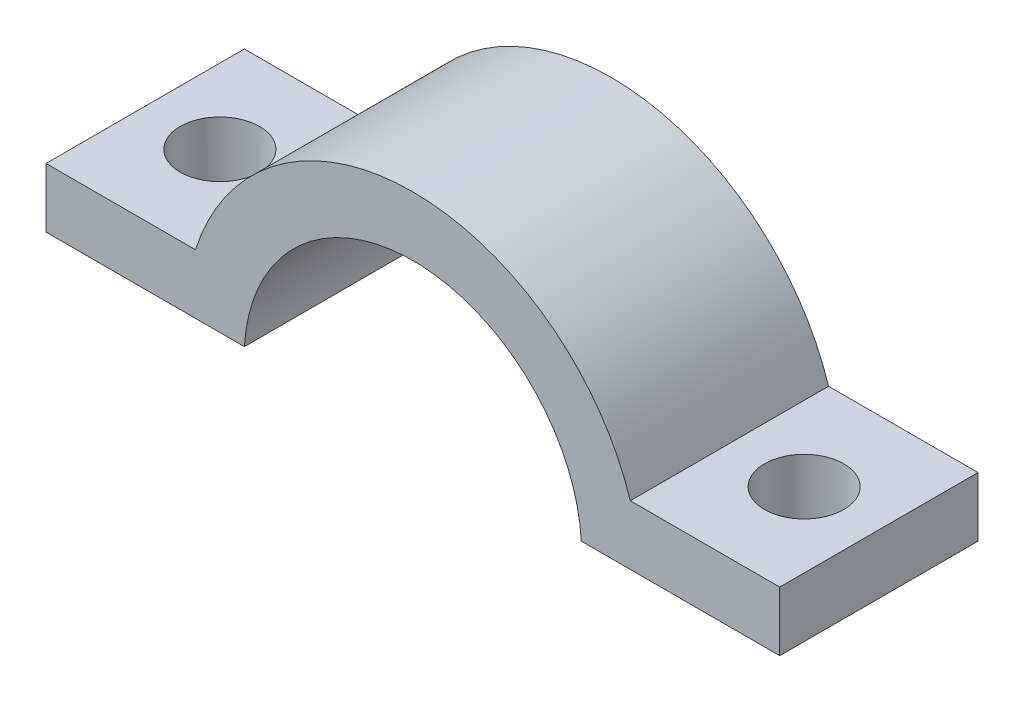
ISO-10303-21;
HEADER;
FILE_DESCRIPTION(('STEP AP214'),'2;1');
FILE_NAME('part.step','',(''),(''),'','','');
FILE_SCHEMA(('AUTOMOTIVE_DESIGN { 1 0 10303 214 1 1 1 1 }'));
ENDSEC;
DATA;
#1=APPLICATION_CONTEXT('core data for automotive mechanical design processes');
#2=APPLICATION_PROTOCOL_DEFINITION('international standard','automotive_design',2000,#1);
#3=PRODUCT_CONTEXT('',#1,'mechanical');
#4=PRODUCT('Part','Part','',(#3));
#5=PRODUCT_RELATED_PRODUCT_CATEGORY('part','',(#4));
#6=PRODUCT_DEFINITION_FORMATION('','',#4);
#7=PRODUCT_DEFINITION_CONTEXT('part definition',#1,'design');
#8=PRODUCT_DEFINITION('design','',#6,#7);
#9=PRODUCT_DEFINITION_SHAPE('','',#8);
#10=(LENGTH_UNIT() NAMED_UNIT(*) SI_UNIT(.MILLI.,.METRE.));
#11=(NAMED_UNIT(*) PLANE_ANGLE_UNIT() SI_UNIT($,.RADIAN.));
#12=(NAMED_UNIT(*) SI_UNIT($,.STERADIAN.) SOLID_ANGLE_UNIT());
#13=UNCERTAINTY_MEASURE_WITH_UNIT(LENGTH_MEASURE(1.E-05),#10,'distance_accuracy_value','');
#14=(GEOMETRIC_REPRESENTATION_CONTEXT(3) GLOBAL_UNCERTAINTY_ASSIGNED_CONTEXT((#13)) GLOBAL_UNIT_ASSIGNED_CONTEXT((#10,
#11,#12)) REPRESENTATION_CONTEXT('',''));
#15=CARTESIAN_POINT('',(0.,0.,0.));
#16=DIRECTION('',(0.,0.,1.));
#17=DIRECTION('',(1.,0.,0.));
#18=AXIS2_PLACEMENT_3D('',#15,#16,#17);
#19=CARTESIAN_POINT('',(8.49529869986924,0.499999999999997,10.));
#20=DIRECTION('',(0.,1.,0.));
#21=DIRECTION('',(-1.,0.,0.));
#22=AXIS2_PLACEMENT_3D('',#19,#20,#21);
#23=PLANE('',#22);
#24=DIRECTION('',(1.,0.,0.));
#25=VECTOR('',#24,1.);
#26=CARTESIAN_POINT('',(8.49529869986924,0.499999999999997,0.));
#27=LINE('',#26,#25);
#28=CARTESIAN_POINT('',(8.49529869986924,0.499999999999997,0.));
#29=VERTEX_POINT('',#28);
#30=CARTESIAN_POINT('',(18.5,0.499999999999995,0.));
#31=VERTEX_POINT('',#30);
#32=EDGE_CURVE('E143',#29,#31,#27,.T.);
#33=ORIENTED_EDGE('',*,*,#32,.T.);
#34=DIRECTION('',(0.,0.,-1.));
#35=VECTOR('',#34,1.);
#36=CARTESIAN_POINT('',(18.5,0.499999999999995,10.));
#37=LINE('',#36,#35);
#38=CARTESIAN_POINT('',(18.5,0.499999999999995,10.));
#39=VERTEX_POINT('',#38);
#40=EDGE_CURVE('E123',#39,#31,#37,.T.);
#41=ORIENTED_EDGE('',*,*,#40,.F.);
#42=DIRECTION('',(1.,0.,0.));
#43=VECTOR('',#42,1.);
#44=CARTESIAN_POINT('',(8.49529869986924,0.499999999999997,10.));
#45=LINE('',#44,#43);
#46=CARTESIAN_POINT('',(8.49529869986924,0.499999999999997,10.));
#47=VERTEX_POINT('',#46);
#48=EDGE_CURVE('E114',#47,#39,#45,.T.);
#49=ORIENTED_EDGE('',*,*,#48,.F.);
#50=DIRECTION('',(0.,0.,-1.));
#51=VECTOR('',#50,1.);
#52=CARTESIAN_POINT('',(8.49529869986924,0.499999999999997,10.));
#53=LINE('',#52,#51);
#54=EDGE_CURVE('E152',#47,#29,#53,.T.);
#55=ORIENTED_EDGE('',*,*,#54,.T.);
#56=EDGE_LOOP('',(#33,#41,#49,#55));
#57=FACE_BOUND('',#56,.T.);
#58=CARTESIAN_POINT('',(14.7324489890025,0.499999999999997,5.));
#59=DIRECTION('',(0.,1.,0.));
#60=DIRECTION('',(-1.,0.,0.));
#61=AXIS2_PLACEMENT_3D('',#58,#59,#60);
#62=CIRCLE('',#61,2.);
#63=CARTESIAN_POINT('',(12.7324489890025,0.499999999999997,5.));
#64=VERTEX_POINT('',#63);
#65=EDGE_CURVE('E187',#64,#64,#62,.T.);
#66=ORIENTED_EDGE('',*,*,#65,.T.);
#67=EDGE_LOOP('',(#66));
#68=FACE_BOUND('',#67,.T.);
#69=ADVANCED_FACE('F35',(#57,#68),#23,.F.);
#70=CARTESIAN_POINT('',(10.964898554331,3.5001570955073,10.));
#71=DIRECTION('',(0.,-1.,0.));
#72=DIRECTION('',(1.,0.,0.));
#73=AXIS2_PLACEMENT_3D('',#70,#71,#72);
#74=PLANE('',#73);
#75=DIRECTION('',(-1.,0.,0.));
#76=VECTOR('',#75,1.);
#77=CARTESIAN_POINT('',(10.964898554331,3.5001570955073,0.));
#78=LINE('',#77,#76);
#79=CARTESIAN_POINT('',(18.5,3.50015709550731,0.));
#80=VERTEX_POINT('',#79);
#81=CARTESIAN_POINT('',(10.964898554331,3.5001570955073,0.));
#82=VERTEX_POINT('',#81);
#83=EDGE_CURVE('E81',#80,#82,#78,.T.);
#84=ORIENTED_EDGE('',*,*,#83,.T.);
#85=DIRECTION('',(0.,0.,-1.));
#86=VECTOR('',#85,1.);
#87=CARTESIAN_POINT('',(10.964898554331,3.5001570955073,10.));
#88=LINE('',#87,#86);
#89=CARTESIAN_POINT('',(10.964898554331,3.5001570955073,10.));
#90=VERTEX_POINT('',#89);
#91=EDGE_CURVE('E124',#90,#82,#88,.T.);
#92=ORIENTED_EDGE('',*,*,#91,.F.);
#93=DIRECTION('',(-1.,0.,0.));
#94=VECTOR('',#93,1.);
#95=CARTESIAN_POINT('',(10.964898554331,3.5001570955073,10.));
#96=LINE('',#95,#94);
#97=CARTESIAN_POINT('',(18.5,3.50015709550731,10.));
#98=VERTEX_POINT('',#97);
#99=EDGE_CURVE('E112',#98,#90,#96,.T.);
#100=ORIENTED_EDGE('',*,*,#99,.F.);
#101=DIRECTION('',(0.,0.,-1.));
#102=VECTOR('',#101,1.);
#103=CARTESIAN_POINT('',(18.5,3.50015709550731,10.));
#104=LINE('',#103,#102);
#105=EDGE_CURVE('E119',#98,#80,#104,.T.);
#106=ORIENTED_EDGE('',*,*,#105,.T.);
#107=EDGE_LOOP('',(#84,#92,#100,#106));
#108=FACE_BOUND('',#107,.T.);
#109=CARTESIAN_POINT('',(14.7324489890025,3.50015709550731,5.));
#110=DIRECTION('',(0.,-1.,0.));
#111=DIRECTION('',(1.,0.,0.));
#112=AXIS2_PLACEMENT_3D('',#109,#110,#111);
#113=CIRCLE('',#112,2.);
#114=CARTESIAN_POINT('',(16.7324489890025,3.50015709550731,5.));
#115=VERTEX_POINT('',#114);
#116=EDGE_CURVE('E190',#115,#115,#113,.T.);
#117=ORIENTED_EDGE('',*,*,#116,.T.);
#118=EDGE_LOOP('',(#117));
#119=FACE_BOUND('',#118,.T.);
#120=ADVANCED_FACE('F126',(#108,#119),#74,.F.);
#121=CARTESIAN_POINT('',(-10.964898554331,3.5001570955073,10.));
#122=DIRECTION('',(0.,-1.,0.));
#123=DIRECTION('',(1.,0.,0.));
#124=AXIS2_PLACEMENT_3D('',#121,#122,#123);
#125=PLANE('',#124);
#126=DIRECTION('',(-1.,0.,0.));
#127=VECTOR('',#126,1.);
#128=CARTESIAN_POINT('',(-10.964898554331,3.5001570955073,0.));
#129=LINE('',#128,#127);
#130=CARTESIAN_POINT('',(-10.964898554331,3.50015709550731,0.));
#131=VERTEX_POINT('',#130);
#132=CARTESIAN_POINT('',(-18.5,3.50015709550731,0.));
#133=VERTEX_POINT('',#132);
#134=EDGE_CURVE('E133',#131,#133,#129,.T.);
#135=ORIENTED_EDGE('',*,*,#134,.T.);
#136=DIRECTION('',(0.,0.,-1.));
#137=VECTOR('',#136,1.);
#138=CARTESIAN_POINT('',(-18.5,3.50015709550731,10.));
#139=LINE('',#138,#137);
#140=CARTESIAN_POINT('',(-18.5,3.50015709550731,10.));
#141=VERTEX_POINT('',#140);
#142=EDGE_CURVE('E11',#141,#133,#139,.T.);
#143=ORIENTED_EDGE('',*,*,#142,.F.);
#144=DIRECTION('',(-1.,0.,0.));
#145=VECTOR('',#144,1.);
#146=CARTESIAN_POINT('',(-10.964898554331,3.5001570955073,10.));
#147=LINE('',#146,#145);
#148=CARTESIAN_POINT('',(-10.964898554331,3.50015709550731,10.));
#149=VERTEX_POINT('',#148);
#150=EDGE_CURVE('E148',#149,#141,#147,.T.);
#151=ORIENTED_EDGE('',*,*,#150,.F.);
#152=DIRECTION('',(0.,0.,-1.));
#153=VECTOR('',#152,1.);
#154=CARTESIAN_POINT('',(-10.964898554331,3.50015709550731,10.));
#155=LINE('',#154,#153);
#156=EDGE_CURVE('E129',#149,#131,#155,.T.);
#157=ORIENTED_EDGE('',*,*,#156,.T.);
#158=EDGE_LOOP('',(#135,#143,#151,#157));
#159=FACE_BOUND('',#158,.T.);
#160=CARTESIAN_POINT('',(-14.7324489890025,3.50015709550731,5.));
#161=DIRECTION('',(0.,-1.,0.));
#162=DIRECTION('',(1.,0.,0.));
#163=AXIS2_PLACEMENT_3D('',#160,#161,#162);
#164=CIRCLE('',#163,2.);
#165=CARTESIAN_POINT('',(-12.7324489890025,3.50015709550731,5.));
#166=VERTEX_POINT('',#165);
#167=EDGE_CURVE('E137',#166,#166,#164,.T.);
#168=ORIENTED_EDGE('',*,*,#167,.T.);
#169=EDGE_LOOP('',(#168));
#170=FACE_BOUND('',#169,.T.);
#171=ADVANCED_FACE('F37',(#159,#170),#125,.F.);
#172=CARTESIAN_POINT('',(-8.49529869986924,0.499999999999997,10.));
#173=DIRECTION('',(0.,1.,0.));
#174=DIRECTION('',(-1.,0.,0.));
#175=AXIS2_PLACEMENT_3D('',#172,#173,#174);
#176=PLANE('',#175);
#177=DIRECTION('',(1.,0.,0.));
#178=VECTOR('',#177,1.);
#179=CARTESIAN_POINT('',(-8.49529869986924,0.499999999999997,0.));
#180=LINE('',#179,#178);
#181=CARTESIAN_POINT('',(-18.5,0.499999999999995,0.));
#182=VERTEX_POINT('',#181);
#183=CARTESIAN_POINT('',(-8.49529869986924,0.499999999999997,0.));
#184=VERTEX_POINT('',#183);
#185=EDGE_CURVE('E139',#182,#184,#180,.T.);
#186=ORIENTED_EDGE('',*,*,#185,.T.);
#187=DIRECTION('',(0.,0.,-1.));
#188=VECTOR('',#187,1.);
#189=CARTESIAN_POINT('',(-8.49529869986924,0.499999999999997,10.));
#190=LINE('',#189,#188);
#191=CARTESIAN_POINT('',(-8.49529869986924,0.499999999999997,10.));
#192=VERTEX_POINT('',#191);
#193=EDGE_CURVE('E155',#192,#184,#190,.T.);
#194=ORIENTED_EDGE('',*,*,#193,.F.);
#195=DIRECTION('',(1.,0.,0.));
#196=VECTOR('',#195,1.);
#197=CARTESIAN_POINT('',(-8.49529869986924,0.499999999999997,10.));
#198=LINE('',#197,#196);
#199=CARTESIAN_POINT('',(-18.5,0.499999999999995,10.));
#200=VERTEX_POINT('',#199);
#201=EDGE_CURVE('E164',#200,#192,#198,.T.);
#202=ORIENTED_EDGE('',*,*,#201,.F.);
#203=DIRECTION('',(0.,0.,-1.));
#204=VECTOR('',#203,1.);
#205=CARTESIAN_POINT('',(-18.5,0.499999999999995,10.));
#206=LINE('',#205,#204);
#207=EDGE_CURVE('E44',#200,#182,#206,.T.);
#208=ORIENTED_EDGE('',*,*,#207,.T.);
#209=EDGE_LOOP('',(#186,#194,#202,#208));
#210=FACE_BOUND('',#209,.T.);
#211=CARTESIAN_POINT('',(-14.7324489890025,0.499999999999997,5.));
#212=DIRECTION('',(0.,1.,0.));
#213=DIRECTION('',(-1.,0.,0.));
#214=AXIS2_PLACEMENT_3D('',#211,#212,#213);
#215=CIRCLE('',#214,2.);
#216=CARTESIAN_POINT('',(-16.7324489890025,0.499999999999997,5.));
#217=VERTEX_POINT('',#216);
#218=EDGE_CURVE('E184',#217,#217,#215,.T.);
#219=ORIENTED_EDGE('',*,*,#218,.T.);
#220=EDGE_LOOP('',(#219));
#221=FACE_BOUND('',#220,.T.);
#222=ADVANCED_FACE('F161',(#210,#221),#176,.F.);
#223=CARTESIAN_POINT('',(-18.5,3.50015709550731,10.));
#224=DIRECTION('',(1.,0.,0.));
#225=DIRECTION('',(0.,0.,-1.));
#226=AXIS2_PLACEMENT_3D('',#223,#224,#225);
#227=PLANE('',#226);
#228=DIRECTION('',(0.,-1.,0.));
#229=VECTOR('',#228,1.);
#230=CARTESIAN_POINT('',(-18.5,3.50015709550731,0.));
#231=LINE('',#230,#229);
#232=EDGE_CURVE('E136',#133,#182,#231,.T.);
#233=ORIENTED_EDGE('',*,*,#232,.T.);
#234=ORIENTED_EDGE('',*,*,#207,.F.);
#235=DIRECTION('',(0.,-1.,0.));
#236=VECTOR('',#235,1.);
#237=CARTESIAN_POINT('',(-18.5,3.50015709550731,10.));
#238=LINE('',#237,#236);
#239=EDGE_CURVE('E95',#141,#200,#238,.T.);
#240=ORIENTED_EDGE('',*,*,#239,.F.);
#241=ORIENTED_EDGE('',*,*,#142,.T.);
#242=EDGE_LOOP('',(#233,#234,#240,#241));
#243=FACE_BOUND('',#242,.T.);
#244=ADVANCED_FACE('F210',(#243),#227,.F.);
#245=CARTESIAN_POINT('',(0.,0.,10.));
#246=DIRECTION('',(0.,0.,-1.));
#247=DIRECTION('',(-1.,0.,0.));
#248=AXIS2_PLACEMENT_3D('',#245,#246,#247);
#249=CYLINDRICAL_SURFACE('',#248,8.51);
#250=CARTESIAN_POINT('',(0.,0.,0.));
#251=DIRECTION('',(0.,0.,-1.));
#252=DIRECTION('',(1.,0.,0.));
#253=AXIS2_PLACEMENT_3D('',#250,#251,#252);
#254=CIRCLE('',#253,8.51);
#255=EDGE_CURVE('E141',#184,#29,#254,.T.);
#256=ORIENTED_EDGE('',*,*,#255,.T.);
#257=ORIENTED_EDGE('',*,*,#54,.F.);
#258=CARTESIAN_POINT('',(0.,0.,10.));
#259=DIRECTION('',(0.,0.,-1.));
#260=DIRECTION('',(1.,0.,0.));
#261=AXIS2_PLACEMENT_3D('',#258,#259,#260);
#262=CIRCLE('',#261,8.51);
#263=EDGE_CURVE('E176',#192,#47,#262,.T.);
#264=ORIENTED_EDGE('',*,*,#263,.F.);
#265=ORIENTED_EDGE('',*,*,#193,.T.);
#266=EDGE_LOOP('',(#256,#257,#264,#265));
#267=FACE_BOUND('',#266,.T.);
#268=ADVANCED_FACE('F172',(#267),#249,.F.);
#269=CARTESIAN_POINT('',(18.5,3.50015709550731,10.));
#270=DIRECTION('',(-1.,0.,0.));
#271=DIRECTION('',(0.,0.,1.));
#272=AXIS2_PLACEMENT_3D('',#269,#270,#271);
#273=PLANE('',#272);
#274=DIRECTION('',(0.,1.,0.));
#275=VECTOR('',#274,1.);
#276=CARTESIAN_POINT('',(18.5,3.50015709550731,0.));
#277=LINE('',#276,#275);
#278=EDGE_CURVE('E122',#31,#80,#277,.T.);
#279=ORIENTED_EDGE('',*,*,#278,.T.);
#280=ORIENTED_EDGE('',*,*,#105,.F.);
#281=DIRECTION('',(0.,1.,0.));
#282=VECTOR('',#281,1.);
#283=CARTESIAN_POINT('',(18.5,3.50015709550731,10.));
#284=LINE('',#283,#282);
#285=EDGE_CURVE('E108',#39,#98,#284,.T.);
#286=ORIENTED_EDGE('',*,*,#285,.F.);
#287=ORIENTED_EDGE('',*,*,#40,.T.);
#288=EDGE_LOOP('',(#279,#280,#286,#287));
#289=FACE_BOUND('',#288,.T.);
#290=ADVANCED_FACE('F120',(#289),#273,.F.);
#291=CARTESIAN_POINT('',(0.,0.,10.));
#292=DIRECTION('',(0.,0.,-1.));
#293=DIRECTION('',(-1.,0.,0.));
#294=AXIS2_PLACEMENT_3D('',#291,#292,#293);
#295=CYLINDRICAL_SURFACE('',#294,11.51);
#296=CARTESIAN_POINT('',(0.,0.,0.));
#297=DIRECTION('',(0.,0.,1.));
#298=DIRECTION('',(1.,0.,0.));
#299=AXIS2_PLACEMENT_3D('',#296,#297,#298);
#300=CIRCLE('',#299,11.51);
#301=EDGE_CURVE('E87',#82,#131,#300,.T.);
#302=ORIENTED_EDGE('',*,*,#301,.T.);
#303=ORIENTED_EDGE('',*,*,#156,.F.);
#304=CARTESIAN_POINT('',(0.,0.,10.));
#305=DIRECTION('',(0.,0.,1.));
#306=DIRECTION('',(1.,0.,0.));
#307=AXIS2_PLACEMENT_3D('',#304,#305,#306);
#308=CIRCLE('',#307,11.51);
#309=EDGE_CURVE('E52',#90,#149,#308,.T.);
#310=ORIENTED_EDGE('',*,*,#309,.F.);
#311=ORIENTED_EDGE('',*,*,#91,.T.);
#312=EDGE_LOOP('',(#302,#303,#310,#311));
#313=FACE_BOUND('',#312,.T.);
#314=ADVANCED_FACE('F219',(#313),#295,.T.);
#315=CARTESIAN_POINT('',(0.,0.,10.));
#316=DIRECTION('',(0.,0.,1.));
#317=DIRECTION('',(1.,0.,0.));
#318=AXIS2_PLACEMENT_3D('',#315,#316,#317);
#319=PLANE('',#318);
#320=ORIENTED_EDGE('',*,*,#150,.T.);
#321=ORIENTED_EDGE('',*,*,#239,.T.);
#322=ORIENTED_EDGE('',*,*,#201,.T.);
#323=ORIENTED_EDGE('',*,*,#263,.T.);
#324=ORIENTED_EDGE('',*,*,#48,.T.);
#325=ORIENTED_EDGE('',*,*,#285,.T.);
#326=ORIENTED_EDGE('',*,*,#99,.T.);
#327=ORIENTED_EDGE('',*,*,#309,.T.);
#328=EDGE_LOOP('',(#320,#321,#322,#323,#324,#325,#326,#327));
#329=FACE_BOUND('',#328,.T.);
#330=ADVANCED_FACE('F110',(#329),#319,.T.);
#331=CARTESIAN_POINT('',(0.,0.,0.));
#332=DIRECTION('',(0.,0.,1.));
#333=DIRECTION('',(1.,0.,0.));
#334=AXIS2_PLACEMENT_3D('',#331,#332,#333);
#335=PLANE('',#334);
#336=ORIENTED_EDGE('',*,*,#134,.F.);
#337=ORIENTED_EDGE('',*,*,#301,.F.);
#338=ORIENTED_EDGE('',*,*,#83,.F.);
#339=ORIENTED_EDGE('',*,*,#278,.F.);
#340=ORIENTED_EDGE('',*,*,#32,.F.);
#341=ORIENTED_EDGE('',*,*,#255,.F.);
#342=ORIENTED_EDGE('',*,*,#185,.F.);
#343=ORIENTED_EDGE('',*,*,#232,.F.);
#344=EDGE_LOOP('',(#336,#337,#338,#339,#340,#341,#342,#343));
#345=FACE_BOUND('',#344,.T.);
#346=ADVANCED_FACE('F168',(#345),#335,.F.);
#347=CARTESIAN_POINT('',(-14.7324489890025,11.511,5.));
#348=DIRECTION('',(0.,-1.,0.));
#349=DIRECTION('',(0.,0.,-1.));
#350=AXIS2_PLACEMENT_3D('',#347,#348,#349);
#351=CYLINDRICAL_SURFACE('',#350,2.);
#352=ORIENTED_EDGE('',*,*,#218,.F.);
#353=EDGE_LOOP('',(#352));
#354=FACE_BOUND('',#353,.T.);
#355=ORIENTED_EDGE('',*,*,#167,.F.);
#356=EDGE_LOOP('',(#355));
#357=FACE_BOUND('',#356,.T.);
#358=ADVANCED_FACE('F197',(#354,#357),#351,.F.);
#359=CARTESIAN_POINT('',(14.7324489890025,11.511,5.));
#360=DIRECTION('',(0.,-1.,0.));
#361=DIRECTION('',(0.,0.,-1.));
#362=AXIS2_PLACEMENT_3D('',#359,#360,#361);
#363=CYLINDRICAL_SURFACE('',#362,2.);
#364=ORIENTED_EDGE('',*,*,#116,.F.);
#365=EDGE_LOOP('',(#364));
#366=FACE_BOUND('',#365,.T.);
#367=ORIENTED_EDGE('',*,*,#65,.F.);
#368=EDGE_LOOP('',(#367));
#369=FACE_BOUND('',#368,.T.);
#370=ADVANCED_FACE('F194',(#366,#369),#363,.F.);
#371=CLOSED_SHELL('',(#69,#120,#171,#222,#244,#268,#290,#314,#330,#346,#358,#370));
#372=MANIFOLD_SOLID_BREP('B2',#371);
#373=ADVANCED_BREP_SHAPE_REPRESENTATION('',(#18,#372),#14);
#374=SHAPE_DEFINITION_REPRESENTATION(#9,#373);
ENDSEC;
END-ISO-10303-21;
